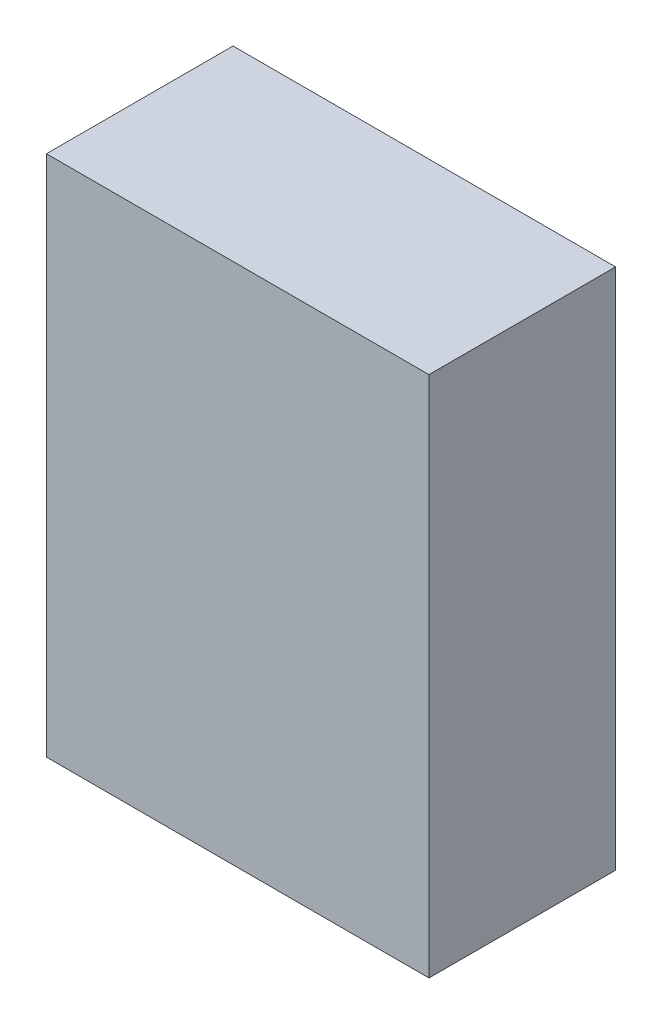
ISO-10303-21;
HEADER;
FILE_DESCRIPTION(('STEP AP214'),'2;1');
FILE_NAME('part.step','',(''),(''),'','','');
FILE_SCHEMA(('AUTOMOTIVE_DESIGN { 1 0 10303 214 1 1 1 1 }'));
ENDSEC;
DATA;
#1=APPLICATION_CONTEXT('core data for automotive mechanical design processes');
#2=APPLICATION_PROTOCOL_DEFINITION('international standard','automotive_design',2000,#1);
#3=PRODUCT_CONTEXT('',#1,'mechanical');
#4=PRODUCT('Part','Part','',(#3));
#5=PRODUCT_RELATED_PRODUCT_CATEGORY('part','',(#4));
#6=PRODUCT_DEFINITION_FORMATION('','',#4);
#7=PRODUCT_DEFINITION_CONTEXT('part definition',#1,'design');
#8=PRODUCT_DEFINITION('design','',#6,#7);
#9=PRODUCT_DEFINITION_SHAPE('','',#8);
#10=(LENGTH_UNIT() NAMED_UNIT(*) SI_UNIT(.MILLI.,.METRE.));
#11=(NAMED_UNIT(*) PLANE_ANGLE_UNIT() SI_UNIT($,.RADIAN.));
#12=(NAMED_UNIT(*) SI_UNIT($,.STERADIAN.) SOLID_ANGLE_UNIT());
#13=UNCERTAINTY_MEASURE_WITH_UNIT(LENGTH_MEASURE(1.E-05),#10,'distance_accuracy_value','');
#14=(GEOMETRIC_REPRESENTATION_CONTEXT(3) GLOBAL_UNCERTAINTY_ASSIGNED_CONTEXT((#13)) GLOBAL_UNIT_ASSIGNED_CONTEXT((#10,
#11,#12)) REPRESENTATION_CONTEXT('',''));
#15=CARTESIAN_POINT('',(0.,0.,0.));
#16=DIRECTION('',(0.,0.,1.));
#17=DIRECTION('',(1.,0.,0.));
#18=AXIS2_PLACEMENT_3D('',#15,#16,#17);
#19=CARTESIAN_POINT('',(0.,0.,0.2));
#20=DIRECTION('',(0.,0.,1.));
#21=DIRECTION('',(1.,0.,0.));
#22=AXIS2_PLACEMENT_3D('',#19,#20,#21);
#23=PLANE('',#22);
#24=DIRECTION('',(0.,-1.,0.));
#25=VECTOR('',#24,1.);
#26=CARTESIAN_POINT('',(-2.11,-2.44,0.2));
#27=LINE('',#26,#25);
#28=CARTESIAN_POINT('',(-2.11,-3.,0.2));
#29=VERTEX_POINT('',#28);
#30=CARTESIAN_POINT('',(-2.11,-2.44,0.2));
#31=VERTEX_POINT('',#30);
#32=EDGE_CURVE('E68',#29,#31,#27,.F.);
#33=ORIENTED_EDGE('',*,*,#32,.F.);
#34=DIRECTION('',(1.,0.,0.));
#35=VECTOR('',#34,1.);
#36=CARTESIAN_POINT('',(-2.11,-3.,0.2));
#37=LINE('',#36,#35);
#38=CARTESIAN_POINT('',(-1.7,-3.,0.2));
#39=VERTEX_POINT('',#38);
#40=EDGE_CURVE('E20',#39,#29,#37,.F.);
#41=ORIENTED_EDGE('',*,*,#40,.F.);
#42=DIRECTION('',(0.,1.,0.));
#43=VECTOR('',#42,1.);
#44=CARTESIAN_POINT('',(-1.7,-3.,0.2));
#45=LINE('',#44,#43);
#46=CARTESIAN_POINT('',(-1.7,-2.44,0.2));
#47=VERTEX_POINT('',#46);
#48=EDGE_CURVE('E58',#47,#39,#45,.F.);
#49=ORIENTED_EDGE('',*,*,#48,.F.);
#50=DIRECTION('',(-1.,0.,0.));
#51=VECTOR('',#50,1.);
#52=CARTESIAN_POINT('',(-1.7,-2.44,0.2));
#53=LINE('',#52,#51);
#54=EDGE_CURVE('E53',#31,#47,#53,.F.);
#55=ORIENTED_EDGE('',*,*,#54,.F.);
#56=EDGE_LOOP('',(#33,#41,#49,#55));
#57=FACE_BOUND('',#56,.T.);
#58=ADVANCED_FACE('F17',(#57),#23,.T.);
#59=CARTESIAN_POINT('',(-2.11,-3.,0.));
#60=DIRECTION('',(0.,-1.,0.));
#61=DIRECTION('',(1.,0.,0.));
#62=AXIS2_PLACEMENT_3D('',#59,#60,#61);
#63=PLANE('',#62);
#64=DIRECTION('',(0.,0.,1.));
#65=VECTOR('',#64,1.);
#66=CARTESIAN_POINT('',(-2.11,-3.,0.));
#67=LINE('',#66,#65);
#68=CARTESIAN_POINT('',(-2.11,-3.,0.));
#69=VERTEX_POINT('',#68);
#70=EDGE_CURVE('E79',#69,#29,#67,.T.);
#71=ORIENTED_EDGE('',*,*,#70,.F.);
#72=DIRECTION('',(1.,0.,0.));
#73=VECTOR('',#72,1.);
#74=CARTESIAN_POINT('',(0.,-3.,0.));
#75=LINE('',#74,#73);
#76=CARTESIAN_POINT('',(-1.7,-3.,0.));
#77=VERTEX_POINT('',#76);
#78=EDGE_CURVE('E74',#69,#77,#75,.T.);
#79=ORIENTED_EDGE('',*,*,#78,.T.);
#80=DIRECTION('',(0.,0.,1.));
#81=VECTOR('',#80,1.);
#82=CARTESIAN_POINT('',(-1.7,-3.,0.));
#83=LINE('',#82,#81);
#84=EDGE_CURVE('E63',#39,#77,#83,.F.);
#85=ORIENTED_EDGE('',*,*,#84,.F.);
#86=ORIENTED_EDGE('',*,*,#40,.T.);
#87=EDGE_LOOP('',(#71,#79,#85,#86));
#88=FACE_BOUND('',#87,.T.);
#89=ADVANCED_FACE('F73',(#88),#63,.T.);
#90=CARTESIAN_POINT('',(-1.7,-3.,0.));
#91=DIRECTION('',(1.,0.,0.));
#92=DIRECTION('',(0.,1.,0.));
#93=AXIS2_PLACEMENT_3D('',#90,#91,#92);
#94=PLANE('',#93);
#95=ORIENTED_EDGE('',*,*,#84,.T.);
#96=DIRECTION('',(0.,1.,0.));
#97=VECTOR('',#96,1.);
#98=CARTESIAN_POINT('',(-1.7,0.,0.));
#99=LINE('',#98,#97);
#100=CARTESIAN_POINT('',(-1.7,-2.44,0.));
#101=VERTEX_POINT('',#100);
#102=EDGE_CURVE('E84',#77,#101,#99,.T.);
#103=ORIENTED_EDGE('',*,*,#102,.T.);
#104=DIRECTION('',(0.,0.,1.));
#105=VECTOR('',#104,1.);
#106=CARTESIAN_POINT('',(-1.7,-2.44,0.));
#107=LINE('',#106,#105);
#108=EDGE_CURVE('E65',#47,#101,#107,.F.);
#109=ORIENTED_EDGE('',*,*,#108,.F.);
#110=ORIENTED_EDGE('',*,*,#48,.T.);
#111=EDGE_LOOP('',(#95,#103,#109,#110));
#112=FACE_BOUND('',#111,.T.);
#113=ADVANCED_FACE('F60',(#112),#94,.T.);
#114=CARTESIAN_POINT('',(-1.7,-2.44,0.));
#115=DIRECTION('',(0.,1.,0.));
#116=DIRECTION('',(-1.,0.,0.));
#117=AXIS2_PLACEMENT_3D('',#114,#115,#116);
#118=PLANE('',#117);
#119=ORIENTED_EDGE('',*,*,#108,.T.);
#120=DIRECTION('',(1.,0.,0.));
#121=VECTOR('',#120,1.);
#122=CARTESIAN_POINT('',(0.,-2.44,0.));
#123=LINE('',#122,#121);
#124=CARTESIAN_POINT('',(-2.11,-2.44,0.));
#125=VERTEX_POINT('',#124);
#126=EDGE_CURVE('E26',#101,#125,#123,.F.);
#127=ORIENTED_EDGE('',*,*,#126,.T.);
#128=DIRECTION('',(0.,0.,1.));
#129=VECTOR('',#128,1.);
#130=CARTESIAN_POINT('',(-2.11,-2.44,0.));
#131=LINE('',#130,#129);
#132=EDGE_CURVE('E34',#31,#125,#131,.F.);
#133=ORIENTED_EDGE('',*,*,#132,.F.);
#134=ORIENTED_EDGE('',*,*,#54,.T.);
#135=EDGE_LOOP('',(#119,#127,#133,#134));
#136=FACE_BOUND('',#135,.T.);
#137=ADVANCED_FACE('F88',(#136),#118,.T.);
#138=CARTESIAN_POINT('',(-2.11,-2.44,0.));
#139=DIRECTION('',(-1.,0.,0.));
#140=DIRECTION('',(0.,-1.,0.));
#141=AXIS2_PLACEMENT_3D('',#138,#139,#140);
#142=PLANE('',#141);
#143=ORIENTED_EDGE('',*,*,#132,.T.);
#144=DIRECTION('',(0.,1.,0.));
#145=VECTOR('',#144,1.);
#146=CARTESIAN_POINT('',(-2.11,0.,0.));
#147=LINE('',#146,#145);
#148=EDGE_CURVE('E11',#125,#69,#147,.F.);
#149=ORIENTED_EDGE('',*,*,#148,.T.);
#150=ORIENTED_EDGE('',*,*,#70,.T.);
#151=ORIENTED_EDGE('',*,*,#32,.T.);
#152=EDGE_LOOP('',(#143,#149,#150,#151));
#153=FACE_BOUND('',#152,.T.);
#154=ADVANCED_FACE('F91',(#153),#142,.T.);
#155=CARTESIAN_POINT('',(0.,0.,0.));
#156=DIRECTION('',(0.,0.,1.));
#157=DIRECTION('',(1.,0.,0.));
#158=AXIS2_PLACEMENT_3D('',#155,#156,#157);
#159=PLANE('',#158);
#160=ORIENTED_EDGE('',*,*,#126,.F.);
#161=ORIENTED_EDGE('',*,*,#102,.F.);
#162=ORIENTED_EDGE('',*,*,#78,.F.);
#163=ORIENTED_EDGE('',*,*,#148,.F.);
#164=EDGE_LOOP('',(#160,#161,#162,#163));
#165=FACE_BOUND('',#164,.T.);
#166=ADVANCED_FACE('F90',(#165),#159,.F.);
#167=CLOSED_SHELL('',(#58,#89,#113,#137,#154,#166));
#168=MANIFOLD_SOLID_BREP('B1',#167);
#169=ADVANCED_BREP_SHAPE_REPRESENTATION('',(#18,#168),#14);
#170=SHAPE_DEFINITION_REPRESENTATION(#9,#169);
ENDSEC;
END-ISO-10303-21;
